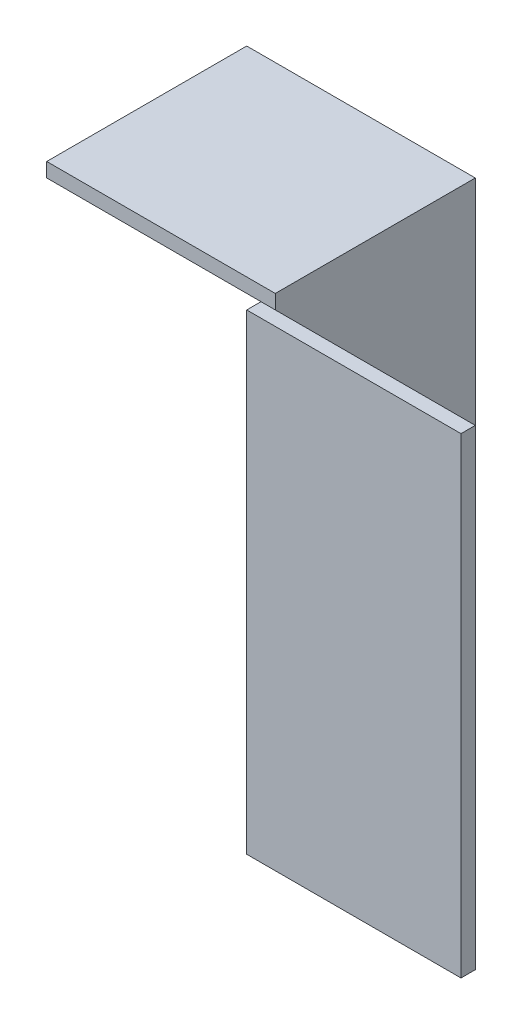
ISO-10303-21;
HEADER;
FILE_DESCRIPTION(('STEP AP214'),'2;1');
FILE_NAME('part.step','',(''),(''),'','','');
FILE_SCHEMA(('AUTOMOTIVE_DESIGN { 1 0 10303 214 1 1 1 1 }'));
ENDSEC;
DATA;
#1=APPLICATION_CONTEXT('core data for automotive mechanical design processes');
#2=APPLICATION_PROTOCOL_DEFINITION('international standard','automotive_design',2000,#1);
#3=PRODUCT_CONTEXT('',#1,'mechanical');
#4=PRODUCT('Part','Part','',(#3));
#5=PRODUCT_RELATED_PRODUCT_CATEGORY('part','',(#4));
#6=PRODUCT_DEFINITION_FORMATION('','',#4);
#7=PRODUCT_DEFINITION_CONTEXT('part definition',#1,'design');
#8=PRODUCT_DEFINITION('design','',#6,#7);
#9=PRODUCT_DEFINITION_SHAPE('','',#8);
#10=(LENGTH_UNIT() NAMED_UNIT(*) SI_UNIT(.MILLI.,.METRE.));
#11=(NAMED_UNIT(*) PLANE_ANGLE_UNIT() SI_UNIT($,.RADIAN.));
#12=(NAMED_UNIT(*) SI_UNIT($,.STERADIAN.) SOLID_ANGLE_UNIT());
#13=UNCERTAINTY_MEASURE_WITH_UNIT(LENGTH_MEASURE(1.E-05),#10,'distance_accuracy_value','');
#14=(GEOMETRIC_REPRESENTATION_CONTEXT(3) GLOBAL_UNCERTAINTY_ASSIGNED_CONTEXT((#13)) GLOBAL_UNIT_ASSIGNED_CONTEXT((#10,
#11,#12)) REPRESENTATION_CONTEXT('',''));
#15=CARTESIAN_POINT('',(0.,0.,0.));
#16=DIRECTION('',(0.,0.,1.));
#17=DIRECTION('',(1.,0.,0.));
#18=AXIS2_PLACEMENT_3D('',#15,#16,#17);
#19=CARTESIAN_POINT('',(15.,53.,0.));
#20=DIRECTION('',(0.,0.,-1.));
#21=DIRECTION('',(-1.,0.,0.));
#22=AXIS2_PLACEMENT_3D('',#19,#20,#21);
#23=PLANE('',#22);
#24=DIRECTION('',(1.,0.,0.));
#25=VECTOR('',#24,1.);
#26=CARTESIAN_POINT('',(0.,33.,0.));
#27=LINE('',#26,#25);
#28=CARTESIAN_POINT('',(0.,33.,0.));
#29=VERTEX_POINT('',#28);
#30=CARTESIAN_POINT('',(15.,33.,0.));
#31=VERTEX_POINT('',#30);
#32=EDGE_CURVE('E145',#29,#31,#27,.T.);
#33=ORIENTED_EDGE('',*,*,#32,.F.);
#34=DIRECTION('',(0.,-1.,0.));
#35=VECTOR('',#34,1.);
#36=CARTESIAN_POINT('',(0.,53.,0.));
#37=LINE('',#36,#35);
#38=CARTESIAN_POINT('',(0.,0.,0.));
#39=VERTEX_POINT('',#38);
#40=EDGE_CURVE('E152',#29,#39,#37,.T.);
#41=ORIENTED_EDGE('',*,*,#40,.T.);
#42=DIRECTION('',(1.,0.,0.));
#43=VECTOR('',#42,1.);
#44=CARTESIAN_POINT('',(15.,0.,0.));
#45=LINE('',#44,#43);
#46=CARTESIAN_POINT('',(15.,0.,0.));
#47=VERTEX_POINT('',#46);
#48=EDGE_CURVE('E185',#39,#47,#45,.T.);
#49=ORIENTED_EDGE('',*,*,#48,.T.);
#50=DIRECTION('',(0.,-1.,0.));
#51=VECTOR('',#50,1.);
#52=CARTESIAN_POINT('',(15.,53.,0.));
#53=LINE('',#52,#51);
#54=EDGE_CURVE('E41',#31,#47,#53,.T.);
#55=ORIENTED_EDGE('',*,*,#54,.F.);
#56=EDGE_LOOP('',(#33,#41,#49,#55));
#57=FACE_BOUND('',#56,.T.);
#58=ADVANCED_FACE('F33',(#57),#23,.F.);
#59=CARTESIAN_POINT('',(15.,53.,-0.999999999999998));
#60=DIRECTION('',(-1.,0.,0.));
#61=DIRECTION('',(0.,0.,1.));
#62=AXIS2_PLACEMENT_3D('',#59,#60,#61);
#63=PLANE('',#62);
#64=DIRECTION('',(0.,0.,-1.));
#65=VECTOR('',#64,1.);
#66=CARTESIAN_POINT('',(15.,33.,0.));
#67=LINE('',#66,#65);
#68=CARTESIAN_POINT('',(15.,33.,-0.999999999999998));
#69=VERTEX_POINT('',#68);
#70=EDGE_CURVE('E180',#31,#69,#67,.T.);
#71=ORIENTED_EDGE('',*,*,#70,.F.);
#72=ORIENTED_EDGE('',*,*,#54,.T.);
#73=DIRECTION('',(0.,0.,-1.));
#74=VECTOR('',#73,1.);
#75=CARTESIAN_POINT('',(15.,0.,-0.999999999999998));
#76=LINE('',#75,#74);
#77=CARTESIAN_POINT('',(15.,0.,-0.999999999999998));
#78=VERTEX_POINT('',#77);
#79=EDGE_CURVE('E178',#47,#78,#76,.T.);
#80=ORIENTED_EDGE('',*,*,#79,.T.);
#81=DIRECTION('',(0.,-1.,0.));
#82=VECTOR('',#81,1.);
#83=CARTESIAN_POINT('',(15.,53.,-0.999999999999998));
#84=LINE('',#83,#82);
#85=EDGE_CURVE('E167',#69,#78,#84,.T.);
#86=ORIENTED_EDGE('',*,*,#85,.F.);
#87=EDGE_LOOP('',(#71,#72,#80,#86));
#88=FACE_BOUND('',#87,.T.);
#89=ADVANCED_FACE('F177',(#88),#63,.F.);
#90=CARTESIAN_POINT('',(1.,53.,-0.999999999999997));
#91=DIRECTION('',(0.,0.,1.));
#92=DIRECTION('',(1.,0.,0.));
#93=AXIS2_PLACEMENT_3D('',#90,#91,#92);
#94=PLANE('',#93);
#95=DIRECTION('',(-1.,0.,0.));
#96=VECTOR('',#95,1.);
#97=CARTESIAN_POINT('',(15.,33.,-0.999999999999998));
#98=LINE('',#97,#96);
#99=CARTESIAN_POINT('',(1.,33.,-0.999999999999997));
#100=VERTEX_POINT('',#99);
#101=EDGE_CURVE('E189',#69,#100,#98,.T.);
#102=ORIENTED_EDGE('',*,*,#101,.F.);
#103=ORIENTED_EDGE('',*,*,#85,.T.);
#104=DIRECTION('',(-1.,0.,0.));
#105=VECTOR('',#104,1.);
#106=CARTESIAN_POINT('',(1.,0.,-0.999999999999997));
#107=LINE('',#106,#105);
#108=CARTESIAN_POINT('',(1.,0.,-0.999999999999997));
#109=VERTEX_POINT('',#108);
#110=EDGE_CURVE('E187',#78,#109,#107,.T.);
#111=ORIENTED_EDGE('',*,*,#110,.T.);
#112=DIRECTION('',(0.,-1.,0.));
#113=VECTOR('',#112,1.);
#114=CARTESIAN_POINT('',(1.,53.,-0.999999999999997));
#115=LINE('',#114,#113);
#116=EDGE_CURVE('E155',#100,#109,#115,.T.);
#117=ORIENTED_EDGE('',*,*,#116,.F.);
#118=EDGE_LOOP('',(#102,#103,#111,#117));
#119=FACE_BOUND('',#118,.T.);
#120=ADVANCED_FACE('F206',(#119),#94,.F.);
#121=CARTESIAN_POINT('',(0.999999999999998,53.,-15.));
#122=DIRECTION('',(-1.,0.,0.));
#123=DIRECTION('',(0.,0.,1.));
#124=AXIS2_PLACEMENT_3D('',#121,#122,#123);
#125=PLANE('',#124);
#126=DIRECTION('',(0.,-1.,0.));
#127=VECTOR('',#126,1.);
#128=CARTESIAN_POINT('',(0.999999999999998,53.,-15.));
#129=LINE('',#128,#127);
#130=CARTESIAN_POINT('',(0.999999999999998,34.,-15.));
#131=VERTEX_POINT('',#130);
#132=CARTESIAN_POINT('',(0.999999999999998,0.,-15.));
#133=VERTEX_POINT('',#132);
#134=EDGE_CURVE('E151',#131,#133,#129,.T.);
#135=ORIENTED_EDGE('',*,*,#134,.F.);
#136=DIRECTION('',(0.,0.,1.));
#137=VECTOR('',#136,1.);
#138=CARTESIAN_POINT('',(0.999999999999998,34.,-15.));
#139=LINE('',#138,#137);
#140=CARTESIAN_POINT('',(1.,34.,-0.999999999999997));
#141=VERTEX_POINT('',#140);
#142=EDGE_CURVE('E111',#131,#141,#139,.T.);
#143=ORIENTED_EDGE('',*,*,#142,.T.);
#144=DIRECTION('',(0.,-1.,0.));
#145=VECTOR('',#144,1.);
#146=CARTESIAN_POINT('',(1.,33.,-0.999999999999997));
#147=LINE('',#146,#145);
#148=EDGE_CURVE('E130',#141,#100,#147,.T.);
#149=ORIENTED_EDGE('',*,*,#148,.T.);
#150=ORIENTED_EDGE('',*,*,#116,.T.);
#151=DIRECTION('',(0.,0.,-1.));
#152=VECTOR('',#151,1.);
#153=CARTESIAN_POINT('',(0.999999999999998,0.,-15.));
#154=LINE('',#153,#152);
#155=EDGE_CURVE('E194',#109,#133,#154,.T.);
#156=ORIENTED_EDGE('',*,*,#155,.T.);
#157=EDGE_LOOP('',(#135,#143,#149,#150,#156));
#158=FACE_BOUND('',#157,.T.);
#159=ADVANCED_FACE('F205',(#158),#125,.F.);
#160=CARTESIAN_POINT('',(0.,53.,-15.));
#161=DIRECTION('',(0.,0.,1.));
#162=DIRECTION('',(1.,0.,0.));
#163=AXIS2_PLACEMENT_3D('',#160,#161,#162);
#164=PLANE('',#163);
#165=DIRECTION('',(0.,-1.,0.));
#166=VECTOR('',#165,1.);
#167=CARTESIAN_POINT('',(0.,53.,-15.));
#168=LINE('',#167,#166);
#169=CARTESIAN_POINT('',(0.,33.,-15.));
#170=VERTEX_POINT('',#169);
#171=CARTESIAN_POINT('',(0.,0.,-15.));
#172=VERTEX_POINT('',#171);
#173=EDGE_CURVE('E150',#170,#172,#168,.T.);
#174=ORIENTED_EDGE('',*,*,#173,.F.);
#175=DIRECTION('',(1.,0.,0.));
#176=VECTOR('',#175,1.);
#177=CARTESIAN_POINT('',(-15.,33.,-15.));
#178=LINE('',#177,#176);
#179=CARTESIAN_POINT('',(-15.,33.,-15.));
#180=VERTEX_POINT('',#179);
#181=EDGE_CURVE('E129',#180,#170,#178,.T.);
#182=ORIENTED_EDGE('',*,*,#181,.F.);
#183=DIRECTION('',(0.,1.,0.));
#184=VECTOR('',#183,1.);
#185=CARTESIAN_POINT('',(-15.,33.,-15.));
#186=LINE('',#185,#184);
#187=CARTESIAN_POINT('',(-15.,34.,-15.));
#188=VERTEX_POINT('',#187);
#189=EDGE_CURVE('E122',#180,#188,#186,.T.);
#190=ORIENTED_EDGE('',*,*,#189,.T.);
#191=DIRECTION('',(1.,0.,0.));
#192=VECTOR('',#191,1.);
#193=CARTESIAN_POINT('',(-15.,34.,-15.));
#194=LINE('',#193,#192);
#195=EDGE_CURVE('E106',#188,#131,#194,.T.);
#196=ORIENTED_EDGE('',*,*,#195,.T.);
#197=ORIENTED_EDGE('',*,*,#134,.T.);
#198=DIRECTION('',(-1.,0.,0.));
#199=VECTOR('',#198,1.);
#200=CARTESIAN_POINT('',(0.,0.,-15.));
#201=LINE('',#200,#199);
#202=EDGE_CURVE('E163',#133,#172,#201,.T.);
#203=ORIENTED_EDGE('',*,*,#202,.T.);
#204=EDGE_LOOP('',(#174,#182,#190,#196,#197,#203));
#205=FACE_BOUND('',#204,.T.);
#206=ADVANCED_FACE('F127',(#205),#164,.F.);
#207=CARTESIAN_POINT('',(0.,53.,0.));
#208=DIRECTION('',(1.,0.,0.));
#209=DIRECTION('',(0.,0.,-1.));
#210=AXIS2_PLACEMENT_3D('',#207,#208,#209);
#211=PLANE('',#210);
#212=DIRECTION('',(0.,0.,1.));
#213=VECTOR('',#212,1.);
#214=CARTESIAN_POINT('',(0.,33.,-15.));
#215=LINE('',#214,#213);
#216=CARTESIAN_POINT('',(0.,33.,-0.999999999999997));
#217=VERTEX_POINT('',#216);
#218=EDGE_CURVE('E55',#170,#217,#215,.T.);
#219=ORIENTED_EDGE('',*,*,#218,.F.);
#220=ORIENTED_EDGE('',*,*,#173,.T.);
#221=DIRECTION('',(0.,0.,1.));
#222=VECTOR('',#221,1.);
#223=CARTESIAN_POINT('',(0.,0.,0.));
#224=LINE('',#223,#222);
#225=EDGE_CURVE('E157',#172,#39,#224,.T.);
#226=ORIENTED_EDGE('',*,*,#225,.T.);
#227=ORIENTED_EDGE('',*,*,#40,.F.);
#228=EDGE_CURVE('E142',#217,#29,#215,.T.);
#229=ORIENTED_EDGE('',*,*,#228,.F.);
#230=EDGE_LOOP('',(#219,#220,#226,#227,#229));
#231=FACE_BOUND('',#230,.T.);
#232=ADVANCED_FACE('F197',(#231),#211,.F.);
#233=CARTESIAN_POINT('',(0.,0.,0.));
#234=DIRECTION('',(0.,-1.,0.));
#235=DIRECTION('',(0.,0.,-1.));
#236=AXIS2_PLACEMENT_3D('',#233,#234,#235);
#237=PLANE('',#236);
#238=ORIENTED_EDGE('',*,*,#48,.F.);
#239=ORIENTED_EDGE('',*,*,#225,.F.);
#240=ORIENTED_EDGE('',*,*,#202,.F.);
#241=ORIENTED_EDGE('',*,*,#155,.F.);
#242=ORIENTED_EDGE('',*,*,#110,.F.);
#243=ORIENTED_EDGE('',*,*,#79,.F.);
#244=EDGE_LOOP('',(#238,#239,#240,#241,#242,#243));
#245=FACE_BOUND('',#244,.T.);
#246=ADVANCED_FACE('F183',(#245),#237,.T.);
#247=CARTESIAN_POINT('',(0.,33.,0.));
#248=DIRECTION('',(0.,1.,0.));
#249=DIRECTION('',(0.,0.,1.));
#250=AXIS2_PLACEMENT_3D('',#247,#248,#249);
#251=PLANE('',#250);
#252=DIRECTION('',(1.,0.,0.));
#253=VECTOR('',#252,1.);
#254=CARTESIAN_POINT('',(-15.,33.,-0.999999999999995));
#255=LINE('',#254,#253);
#256=EDGE_CURVE('E11',#217,#100,#255,.T.);
#257=ORIENTED_EDGE('',*,*,#256,.F.);
#258=ORIENTED_EDGE('',*,*,#228,.T.);
#259=ORIENTED_EDGE('',*,*,#32,.T.);
#260=ORIENTED_EDGE('',*,*,#70,.T.);
#261=ORIENTED_EDGE('',*,*,#101,.T.);
#262=EDGE_LOOP('',(#257,#258,#259,#260,#261));
#263=FACE_BOUND('',#262,.T.);
#264=ADVANCED_FACE('F259',(#263),#251,.T.);
#265=CARTESIAN_POINT('',(-15.,33.,-15.));
#266=DIRECTION('',(0.,-1.,0.));
#267=DIRECTION('',(0.,0.,-1.));
#268=AXIS2_PLACEMENT_3D('',#265,#266,#267);
#269=PLANE('',#268);
#270=ORIENTED_EDGE('',*,*,#181,.T.);
#271=ORIENTED_EDGE('',*,*,#218,.T.);
#272=CARTESIAN_POINT('',(-15.,33.,-0.999999999999995));
#273=VERTEX_POINT('',#272);
#274=EDGE_CURVE('E43',#273,#217,#255,.T.);
#275=ORIENTED_EDGE('',*,*,#274,.F.);
#276=DIRECTION('',(0.,0.,-1.));
#277=VECTOR('',#276,1.);
#278=CARTESIAN_POINT('',(-15.,33.,-15.));
#279=LINE('',#278,#277);
#280=EDGE_CURVE('E115',#273,#180,#279,.T.);
#281=ORIENTED_EDGE('',*,*,#280,.T.);
#282=EDGE_LOOP('',(#270,#271,#275,#281));
#283=FACE_BOUND('',#282,.T.);
#284=ADVANCED_FACE('F200',(#283),#269,.T.);
#285=CARTESIAN_POINT('',(-15.,33.,-0.999999999999995));
#286=DIRECTION('',(0.,0.,1.));
#287=DIRECTION('',(0.,-1.,0.));
#288=AXIS2_PLACEMENT_3D('',#285,#286,#287);
#289=PLANE('',#288);
#290=ORIENTED_EDGE('',*,*,#148,.F.);
#291=DIRECTION('',(1.,0.,0.));
#292=VECTOR('',#291,1.);
#293=CARTESIAN_POINT('',(-15.,34.,-0.999999999999995));
#294=LINE('',#293,#292);
#295=CARTESIAN_POINT('',(-15.,34.,-0.999999999999995));
#296=VERTEX_POINT('',#295);
#297=EDGE_CURVE('E114',#296,#141,#294,.T.);
#298=ORIENTED_EDGE('',*,*,#297,.F.);
#299=DIRECTION('',(0.,-1.,0.));
#300=VECTOR('',#299,1.);
#301=CARTESIAN_POINT('',(-15.,33.,-0.999999999999995));
#302=LINE('',#301,#300);
#303=EDGE_CURVE('E125',#296,#273,#302,.T.);
#304=ORIENTED_EDGE('',*,*,#303,.T.);
#305=ORIENTED_EDGE('',*,*,#274,.T.);
#306=ORIENTED_EDGE('',*,*,#256,.T.);
#307=EDGE_LOOP('',(#290,#298,#304,#305,#306));
#308=FACE_BOUND('',#307,.T.);
#309=ADVANCED_FACE('F203',(#308),#289,.T.);
#310=CARTESIAN_POINT('',(-15.,34.,-15.));
#311=DIRECTION('',(0.,1.,0.));
#312=DIRECTION('',(0.,0.,1.));
#313=AXIS2_PLACEMENT_3D('',#310,#311,#312);
#314=PLANE('',#313);
#315=ORIENTED_EDGE('',*,*,#142,.F.);
#316=ORIENTED_EDGE('',*,*,#195,.F.);
#317=DIRECTION('',(0.,0.,1.));
#318=VECTOR('',#317,1.);
#319=CARTESIAN_POINT('',(-15.,34.,-15.));
#320=LINE('',#319,#318);
#321=EDGE_CURVE('E109',#188,#296,#320,.T.);
#322=ORIENTED_EDGE('',*,*,#321,.T.);
#323=ORIENTED_EDGE('',*,*,#297,.T.);
#324=EDGE_LOOP('',(#315,#316,#322,#323));
#325=FACE_BOUND('',#324,.T.);
#326=ADVANCED_FACE('F108',(#325),#314,.T.);
#327=CARTESIAN_POINT('',(-15.,0.,0.));
#328=DIRECTION('',(1.,0.,0.));
#329=DIRECTION('',(0.,0.,-1.));
#330=AXIS2_PLACEMENT_3D('',#327,#328,#329);
#331=PLANE('',#330);
#332=ORIENTED_EDGE('',*,*,#189,.F.);
#333=ORIENTED_EDGE('',*,*,#280,.F.);
#334=ORIENTED_EDGE('',*,*,#303,.F.);
#335=ORIENTED_EDGE('',*,*,#321,.F.);
#336=EDGE_LOOP('',(#332,#333,#334,#335));
#337=FACE_BOUND('',#336,.T.);
#338=ADVANCED_FACE('F120',(#337),#331,.F.);
#339=CLOSED_SHELL('',(#58,#89,#120,#159,#206,#232,#246,#264,#284,#309,#326,#338));
#340=MANIFOLD_SOLID_BREP('B2',#339);
#341=ADVANCED_BREP_SHAPE_REPRESENTATION('',(#18,#340),#14);
#342=SHAPE_DEFINITION_REPRESENTATION(#9,#341);
ENDSEC;
END-ISO-10303-21;
